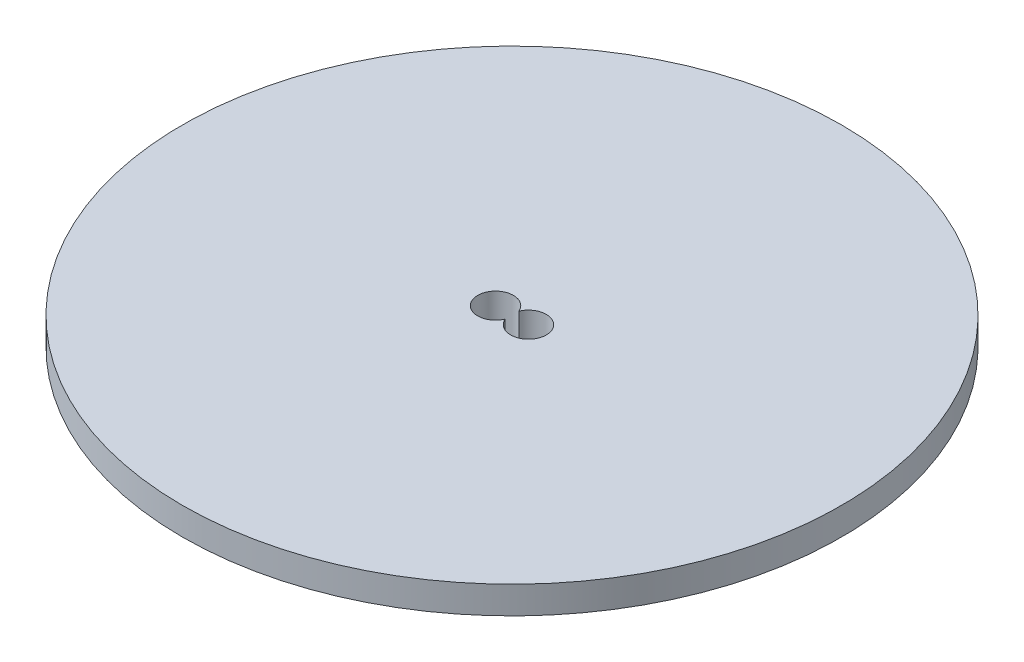
ISO-10303-21;
HEADER;
FILE_DESCRIPTION(('STEP AP214'),'2;1');
FILE_NAME('part.step','',(''),(''),'','','');
FILE_SCHEMA(('AUTOMOTIVE_DESIGN { 1 0 10303 214 1 1 1 1 }'));
ENDSEC;
DATA;
#1=APPLICATION_CONTEXT('core data for automotive mechanical design processes');
#2=APPLICATION_PROTOCOL_DEFINITION('international standard','automotive_design',2000,#1);
#3=PRODUCT_CONTEXT('',#1,'mechanical');
#4=PRODUCT('Part','Part','',(#3));
#5=PRODUCT_RELATED_PRODUCT_CATEGORY('part','',(#4));
#6=PRODUCT_DEFINITION_FORMATION('','',#4);
#7=PRODUCT_DEFINITION_CONTEXT('part definition',#1,'design');
#8=PRODUCT_DEFINITION('design','',#6,#7);
#9=PRODUCT_DEFINITION_SHAPE('','',#8);
#10=(LENGTH_UNIT() NAMED_UNIT(*) SI_UNIT(.MILLI.,.METRE.));
#11=(NAMED_UNIT(*) PLANE_ANGLE_UNIT() SI_UNIT($,.RADIAN.));
#12=(NAMED_UNIT(*) SI_UNIT($,.STERADIAN.) SOLID_ANGLE_UNIT());
#13=UNCERTAINTY_MEASURE_WITH_UNIT(LENGTH_MEASURE(1.E-05),#10,'distance_accuracy_value','');
#14=(GEOMETRIC_REPRESENTATION_CONTEXT(3) GLOBAL_UNCERTAINTY_ASSIGNED_CONTEXT((#13)) GLOBAL_UNIT_ASSIGNED_CONTEXT((#10,
#11,#12)) REPRESENTATION_CONTEXT('',''));
#15=CARTESIAN_POINT('',(0.,0.,0.));
#16=DIRECTION('',(0.,0.,1.));
#17=DIRECTION('',(1.,0.,0.));
#18=AXIS2_PLACEMENT_3D('',#15,#16,#17);
#19=CARTESIAN_POINT('',(0.,0.,0.));
#20=DIRECTION('',(0.,1.,0.));
#21=DIRECTION('',(0.,0.,1.));
#22=AXIS2_PLACEMENT_3D('',#19,#20,#21);
#23=PLANE('',#22);
#24=DIRECTION('',(0.,0.,1.));
#25=VECTOR('',#24,1.);
#26=CARTESIAN_POINT('',(-15.6602540378444,0.,0.));
#27=LINE('',#26,#25);
#28=CARTESIAN_POINT('',(-15.6602540378444,0.,-12.1602540378444));
#29=VERTEX_POINT('',#28);
#30=CARTESIAN_POINT('',(-15.6602540378444,0.,12.1602540378444));
#31=VERTEX_POINT('',#30);
#32=EDGE_CURVE('E57',#29,#31,#27,.T.);
#33=ORIENTED_EDGE('',*,*,#32,.T.);
#34=DIRECTION('',(1.,0.,0.));
#35=VECTOR('',#34,1.);
#36=CARTESIAN_POINT('',(0.,0.,12.1602540378444));
#37=LINE('',#36,#35);
#38=CARTESIAN_POINT('',(15.6602540378444,0.,12.1602540378444));
#39=VERTEX_POINT('',#38);
#40=EDGE_CURVE('E11',#31,#39,#37,.T.);
#41=ORIENTED_EDGE('',*,*,#40,.T.);
#42=DIRECTION('',(0.,0.,-1.));
#43=VECTOR('',#42,1.);
#44=CARTESIAN_POINT('',(15.6602540378444,0.,0.));
#45=LINE('',#44,#43);
#46=CARTESIAN_POINT('',(15.6602540378444,0.,-12.1602540378444));
#47=VERTEX_POINT('',#46);
#48=EDGE_CURVE('E42',#39,#47,#45,.T.);
#49=ORIENTED_EDGE('',*,*,#48,.T.);
#50=DIRECTION('',(-1.,0.,0.));
#51=VECTOR('',#50,1.);
#52=CARTESIAN_POINT('',(0.,0.,-12.1602540378444));
#53=LINE('',#52,#51);
#54=EDGE_CURVE('E128',#47,#29,#53,.T.);
#55=ORIENTED_EDGE('',*,*,#54,.T.);
#56=EDGE_LOOP('',(#33,#41,#49,#55));
#57=FACE_BOUND('',#56,.T.);
#58=CARTESIAN_POINT('',(0.,0.,0.));
#59=DIRECTION('',(0.,1.,0.));
#60=DIRECTION('',(0.,0.,1.));
#61=AXIS2_PLACEMENT_3D('',#58,#59,#60);
#62=CIRCLE('',#61,60.);
#63=CARTESIAN_POINT('',(0.,0.,60.));
#64=VERTEX_POINT('',#63);
#65=EDGE_CURVE('E124',#64,#64,#62,.T.);
#66=ORIENTED_EDGE('',*,*,#65,.F.);
#67=EDGE_LOOP('',(#66));
#68=FACE_BOUND('',#67,.T.);
#69=ADVANCED_FACE('F33',(#57,#68),#23,.F.);
#70=CARTESIAN_POINT('',(0.,5.,0.));
#71=DIRECTION('',(0.,-1.,0.));
#72=DIRECTION('',(0.,0.,-1.));
#73=AXIS2_PLACEMENT_3D('',#70,#71,#72);
#74=CYLINDRICAL_SURFACE('',#73,60.);
#75=CARTESIAN_POINT('',(0.,5.,0.));
#76=DIRECTION('',(0.,1.,0.));
#77=DIRECTION('',(0.,0.,1.));
#78=AXIS2_PLACEMENT_3D('',#75,#76,#77);
#79=CIRCLE('',#78,60.);
#80=CARTESIAN_POINT('',(0.,5.,60.));
#81=VERTEX_POINT('',#80);
#82=EDGE_CURVE('E125',#81,#81,#79,.T.);
#83=ORIENTED_EDGE('',*,*,#82,.F.);
#84=EDGE_LOOP('',(#83));
#85=FACE_BOUND('',#84,.T.);
#86=ORIENTED_EDGE('',*,*,#65,.T.);
#87=EDGE_LOOP('',(#86));
#88=FACE_BOUND('',#87,.T.);
#89=ADVANCED_FACE('F175',(#85,#88),#74,.T.);
#90=CARTESIAN_POINT('',(0.,5.,0.));
#91=DIRECTION('',(0.,1.,0.));
#92=DIRECTION('',(0.,0.,1.));
#93=AXIS2_PLACEMENT_3D('',#90,#91,#92);
#94=PLANE('',#93);
#95=CARTESIAN_POINT('',(-3.,5.,0.));
#96=DIRECTION('',(0.,1.,0.));
#97=DIRECTION('',(0.,0.,1.));
#98=AXIS2_PLACEMENT_3D('',#95,#96,#97);
#99=CIRCLE('',#98,3.25);
#100=CARTESIAN_POINT('',(0.,5.,-1.25));
#101=VERTEX_POINT('',#100);
#102=CARTESIAN_POINT('',(0.,5.,1.25));
#103=VERTEX_POINT('',#102);
#104=EDGE_CURVE('E95',#101,#103,#99,.T.);
#105=ORIENTED_EDGE('',*,*,#104,.F.);
#106=CARTESIAN_POINT('',(3.,5.,0.));
#107=DIRECTION('',(0.,1.,0.));
#108=DIRECTION('',(0.,0.,1.));
#109=AXIS2_PLACEMENT_3D('',#106,#107,#108);
#110=CIRCLE('',#109,3.25);
#111=EDGE_CURVE('E105',#103,#101,#110,.T.);
#112=ORIENTED_EDGE('',*,*,#111,.F.);
#113=EDGE_LOOP('',(#105,#112));
#114=FACE_BOUND('',#113,.T.);
#115=ORIENTED_EDGE('',*,*,#82,.T.);
#116=EDGE_LOOP('',(#115));
#117=FACE_BOUND('',#116,.T.);
#118=ADVANCED_FACE('F180',(#114,#117),#94,.T.);
#119=CARTESIAN_POINT('',(0.,-5.,0.));
#120=DIRECTION('',(0.,1.,0.));
#121=DIRECTION('',(0.,0.,1.));
#122=AXIS2_PLACEMENT_3D('',#119,#120,#121);
#123=PLANE('',#122);
#124=CARTESIAN_POINT('',(-3.,-5.,0.));
#125=DIRECTION('',(0.,1.,0.));
#126=DIRECTION('',(0.,0.,1.));
#127=AXIS2_PLACEMENT_3D('',#124,#125,#126);
#128=CIRCLE('',#127,1.75);
#129=CARTESIAN_POINT('',(-3.,-5.,1.75));
#130=VERTEX_POINT('',#129);
#131=EDGE_CURVE('E112',#130,#130,#128,.T.);
#132=ORIENTED_EDGE('',*,*,#131,.T.);
#133=EDGE_LOOP('',(#132));
#134=FACE_BOUND('',#133,.T.);
#135=CARTESIAN_POINT('',(3.,-5.,0.));
#136=DIRECTION('',(0.,1.,0.));
#137=DIRECTION('',(0.,0.,1.));
#138=AXIS2_PLACEMENT_3D('',#135,#136,#137);
#139=CIRCLE('',#138,1.75);
#140=CARTESIAN_POINT('',(3.,-5.,1.75));
#141=VERTEX_POINT('',#140);
#142=EDGE_CURVE('E133',#141,#141,#139,.T.);
#143=ORIENTED_EDGE('',*,*,#142,.T.);
#144=EDGE_LOOP('',(#143));
#145=FACE_BOUND('',#144,.T.);
#146=DIRECTION('',(0.,0.,1.));
#147=VECTOR('',#146,1.);
#148=CARTESIAN_POINT('',(7.,-5.,-3.5));
#149=LINE('',#148,#147);
#150=CARTESIAN_POINT('',(7.,-5.,-3.5));
#151=VERTEX_POINT('',#150);
#152=CARTESIAN_POINT('',(7.,-5.,3.5));
#153=VERTEX_POINT('',#152);
#154=EDGE_CURVE('E114',#151,#153,#149,.T.);
#155=ORIENTED_EDGE('',*,*,#154,.T.);
#156=DIRECTION('',(-1.,0.,0.));
#157=VECTOR('',#156,1.);
#158=CARTESIAN_POINT('',(-7.,-5.,3.5));
#159=LINE('',#158,#157);
#160=CARTESIAN_POINT('',(-7.,-5.,3.5));
#161=VERTEX_POINT('',#160);
#162=EDGE_CURVE('E117',#153,#161,#159,.T.);
#163=ORIENTED_EDGE('',*,*,#162,.T.);
#164=DIRECTION('',(0.,0.,-1.));
#165=VECTOR('',#164,1.);
#166=CARTESIAN_POINT('',(-7.,-5.,-3.5));
#167=LINE('',#166,#165);
#168=CARTESIAN_POINT('',(-7.,-5.,-3.5));
#169=VERTEX_POINT('',#168);
#170=EDGE_CURVE('E120',#161,#169,#167,.T.);
#171=ORIENTED_EDGE('',*,*,#170,.T.);
#172=DIRECTION('',(1.,0.,0.));
#173=VECTOR('',#172,1.);
#174=CARTESIAN_POINT('',(-7.,-5.,-3.5));
#175=LINE('',#174,#173);
#176=EDGE_CURVE('E122',#169,#151,#175,.T.);
#177=ORIENTED_EDGE('',*,*,#176,.T.);
#178=EDGE_LOOP('',(#155,#163,#171,#177));
#179=FACE_BOUND('',#178,.T.);
#180=ADVANCED_FACE('F159',(#134,#145,#179),#123,.F.);
#181=CARTESIAN_POINT('',(-3.,-4.,0.));
#182=DIRECTION('',(0.,1.,0.));
#183=DIRECTION('',(0.,0.,1.));
#184=AXIS2_PLACEMENT_3D('',#181,#182,#183);
#185=CYLINDRICAL_SURFACE('',#184,3.25);
#186=ORIENTED_EDGE('',*,*,#104,.T.);
#187=DIRECTION('',(0.,1.,0.));
#188=VECTOR('',#187,1.);
#189=CARTESIAN_POINT('',(0.,-4.,1.25));
#190=LINE('',#189,#188);
#191=CARTESIAN_POINT('',(0.,-4.,1.25));
#192=VERTEX_POINT('',#191);
#193=EDGE_CURVE('E89',#192,#103,#190,.T.);
#194=ORIENTED_EDGE('',*,*,#193,.F.);
#195=CARTESIAN_POINT('',(-3.,-4.,0.));
#196=DIRECTION('',(0.,1.,0.));
#197=DIRECTION('',(0.,0.,1.));
#198=AXIS2_PLACEMENT_3D('',#195,#196,#197);
#199=CIRCLE('',#198,3.25);
#200=CARTESIAN_POINT('',(0.,-4.,-1.25));
#201=VERTEX_POINT('',#200);
#202=EDGE_CURVE('E92',#201,#192,#199,.T.);
#203=ORIENTED_EDGE('',*,*,#202,.F.);
#204=DIRECTION('',(0.,1.,0.));
#205=VECTOR('',#204,1.);
#206=CARTESIAN_POINT('',(0.,-4.,-1.25));
#207=LINE('',#206,#205);
#208=EDGE_CURVE('E100',#201,#101,#207,.T.);
#209=ORIENTED_EDGE('',*,*,#208,.T.);
#210=EDGE_LOOP('',(#186,#194,#203,#209));
#211=FACE_BOUND('',#210,.T.);
#212=ADVANCED_FACE('F91',(#211),#185,.F.);
#213=CARTESIAN_POINT('',(3.,-4.,0.));
#214=DIRECTION('',(0.,1.,0.));
#215=DIRECTION('',(0.,0.,1.));
#216=AXIS2_PLACEMENT_3D('',#213,#214,#215);
#217=CYLINDRICAL_SURFACE('',#216,3.25);
#218=ORIENTED_EDGE('',*,*,#111,.T.);
#219=ORIENTED_EDGE('',*,*,#208,.F.);
#220=CARTESIAN_POINT('',(3.,-4.,0.));
#221=DIRECTION('',(0.,1.,0.));
#222=DIRECTION('',(0.,0.,1.));
#223=AXIS2_PLACEMENT_3D('',#220,#221,#222);
#224=CIRCLE('',#223,3.25);
#225=EDGE_CURVE('E101',#192,#201,#224,.T.);
#226=ORIENTED_EDGE('',*,*,#225,.F.);
#227=ORIENTED_EDGE('',*,*,#193,.T.);
#228=EDGE_LOOP('',(#218,#219,#226,#227));
#229=FACE_BOUND('',#228,.T.);
#230=ADVANCED_FACE('F107',(#229),#217,.F.);
#231=CARTESIAN_POINT('',(0.,-4.,0.));
#232=DIRECTION('',(0.,1.,0.));
#233=DIRECTION('',(0.,0.,1.));
#234=AXIS2_PLACEMENT_3D('',#231,#232,#233);
#235=PLANE('',#234);
#236=CARTESIAN_POINT('',(-3.,-4.,0.));
#237=DIRECTION('',(0.,1.,0.));
#238=DIRECTION('',(0.,0.,1.));
#239=AXIS2_PLACEMENT_3D('',#236,#237,#238);
#240=CIRCLE('',#239,1.75);
#241=CARTESIAN_POINT('',(-3.,-4.,1.75));
#242=VERTEX_POINT('',#241);
#243=EDGE_CURVE('E150',#242,#242,#240,.T.);
#244=ORIENTED_EDGE('',*,*,#243,.F.);
#245=EDGE_LOOP('',(#244));
#246=FACE_BOUND('',#245,.T.);
#247=CARTESIAN_POINT('',(3.,-4.,0.));
#248=DIRECTION('',(0.,1.,0.));
#249=DIRECTION('',(0.,0.,1.));
#250=AXIS2_PLACEMENT_3D('',#247,#248,#249);
#251=CIRCLE('',#250,1.75);
#252=CARTESIAN_POINT('',(3.,-4.,1.75));
#253=VERTEX_POINT('',#252);
#254=EDGE_CURVE('E145',#253,#253,#251,.T.);
#255=ORIENTED_EDGE('',*,*,#254,.F.);
#256=EDGE_LOOP('',(#255));
#257=FACE_BOUND('',#256,.T.);
#258=ORIENTED_EDGE('',*,*,#202,.T.);
#259=ORIENTED_EDGE('',*,*,#225,.T.);
#260=EDGE_LOOP('',(#258,#259));
#261=FACE_BOUND('',#260,.T.);
#262=ADVANCED_FACE('F104',(#246,#257,#261),#235,.T.);
#263=CARTESIAN_POINT('',(3.,-9.,0.));
#264=DIRECTION('',(0.,1.,0.));
#265=DIRECTION('',(0.,0.,1.));
#266=AXIS2_PLACEMENT_3D('',#263,#264,#265);
#267=CYLINDRICAL_SURFACE('',#266,1.75);
#268=ORIENTED_EDGE('',*,*,#254,.T.);
#269=EDGE_LOOP('',(#268));
#270=FACE_BOUND('',#269,.T.);
#271=ORIENTED_EDGE('',*,*,#142,.F.);
#272=EDGE_LOOP('',(#271));
#273=FACE_BOUND('',#272,.T.);
#274=ADVANCED_FACE('F162',(#270,#273),#267,.F.);
#275=CARTESIAN_POINT('',(-3.,-9.,0.));
#276=DIRECTION('',(0.,1.,0.));
#277=DIRECTION('',(0.,0.,1.));
#278=AXIS2_PLACEMENT_3D('',#275,#276,#277);
#279=CYLINDRICAL_SURFACE('',#278,1.75);
#280=ORIENTED_EDGE('',*,*,#243,.T.);
#281=EDGE_LOOP('',(#280));
#282=FACE_BOUND('',#281,.T.);
#283=ORIENTED_EDGE('',*,*,#131,.F.);
#284=EDGE_LOOP('',(#283));
#285=FACE_BOUND('',#284,.T.);
#286=ADVANCED_FACE('F164',(#282,#285),#279,.F.);
#287=CARTESIAN_POINT('',(-7.,-10.,-12.1602540378444));
#288=DIRECTION('',(-1.,0.,0.));
#289=DIRECTION('',(0.,0.,1.));
#290=AXIS2_PLACEMENT_3D('',#287,#288,#289);
#291=CYLINDRICAL_SURFACE('',#290,10.);
#292=CARTESIAN_POINT('',(-15.6602540378444,-10.,-12.1602540378444));
#293=DIRECTION('',(-0.707106781186547,0.,0.707106781186547));
#294=DIRECTION('',(-0.707106781186547,0.,-0.707106781186547));
#295=AXIS2_PLACEMENT_3D('',#292,#293,#294);
#296=ELLIPSE('',#295,14.1421356237309,10.);
#297=EDGE_CURVE('E139',#29,#169,#296,.F.);
#298=ORIENTED_EDGE('',*,*,#297,.F.);
#299=ORIENTED_EDGE('',*,*,#54,.F.);
#300=CARTESIAN_POINT('',(15.6602540378444,-10.,-12.1602540378444));
#301=DIRECTION('',(-0.707106781186547,0.,-0.707106781186547));
#302=DIRECTION('',(-0.707106781186547,0.,0.707106781186547));
#303=AXIS2_PLACEMENT_3D('',#300,#301,#302);
#304=ELLIPSE('',#303,14.1421356237309,10.);
#305=EDGE_CURVE('E37',#151,#47,#304,.T.);
#306=ORIENTED_EDGE('',*,*,#305,.F.);
#307=ORIENTED_EDGE('',*,*,#176,.F.);
#308=EDGE_LOOP('',(#298,#299,#306,#307));
#309=FACE_BOUND('',#308,.T.);
#310=ADVANCED_FACE('F35',(#309),#291,.F.);
#311=CARTESIAN_POINT('',(15.6602540378444,-10.,-3.5));
#312=DIRECTION('',(0.,0.,-1.));
#313=DIRECTION('',(-1.,0.,0.));
#314=AXIS2_PLACEMENT_3D('',#311,#312,#313);
#315=CYLINDRICAL_SURFACE('',#314,10.);
#316=ORIENTED_EDGE('',*,*,#305,.T.);
#317=ORIENTED_EDGE('',*,*,#48,.F.);
#318=CARTESIAN_POINT('',(15.6602540378444,-10.,12.1602540378444));
#319=DIRECTION('',(0.707106781186547,0.,-0.707106781186547));
#320=DIRECTION('',(-0.707106781186547,0.,-0.707106781186547));
#321=AXIS2_PLACEMENT_3D('',#318,#319,#320);
#322=ELLIPSE('',#321,14.1421356237309,10.);
#323=EDGE_CURVE('E50',#153,#39,#322,.T.);
#324=ORIENTED_EDGE('',*,*,#323,.F.);
#325=ORIENTED_EDGE('',*,*,#154,.F.);
#326=EDGE_LOOP('',(#316,#317,#324,#325));
#327=FACE_BOUND('',#326,.T.);
#328=ADVANCED_FACE('F192',(#327),#315,.F.);
#329=CARTESIAN_POINT('',(-15.6602540378444,-10.,-3.5));
#330=DIRECTION('',(0.,0.,1.));
#331=DIRECTION('',(1.,0.,0.));
#332=AXIS2_PLACEMENT_3D('',#329,#330,#331);
#333=CYLINDRICAL_SURFACE('',#332,10.);
#334=ORIENTED_EDGE('',*,*,#297,.T.);
#335=ORIENTED_EDGE('',*,*,#170,.F.);
#336=CARTESIAN_POINT('',(-15.6602540378444,-10.,12.1602540378444));
#337=DIRECTION('',(0.707106781186547,0.,0.707106781186547));
#338=DIRECTION('',(-0.707106781186547,0.,0.707106781186547));
#339=AXIS2_PLACEMENT_3D('',#336,#337,#338);
#340=ELLIPSE('',#339,14.1421356237309,10.);
#341=EDGE_CURVE('E137',#31,#161,#340,.F.);
#342=ORIENTED_EDGE('',*,*,#341,.F.);
#343=ORIENTED_EDGE('',*,*,#32,.F.);
#344=EDGE_LOOP('',(#334,#335,#342,#343));
#345=FACE_BOUND('',#344,.T.);
#346=ADVANCED_FACE('F190',(#345),#333,.F.);
#347=CARTESIAN_POINT('',(-7.,-10.,12.1602540378444));
#348=DIRECTION('',(1.,0.,0.));
#349=DIRECTION('',(0.,0.,-1.));
#350=AXIS2_PLACEMENT_3D('',#347,#348,#349);
#351=CYLINDRICAL_SURFACE('',#350,10.);
#352=ORIENTED_EDGE('',*,*,#323,.T.);
#353=ORIENTED_EDGE('',*,*,#40,.F.);
#354=ORIENTED_EDGE('',*,*,#341,.T.);
#355=ORIENTED_EDGE('',*,*,#162,.F.);
#356=EDGE_LOOP('',(#352,#353,#354,#355));
#357=FACE_BOUND('',#356,.T.);
#358=ADVANCED_FACE('F187',(#357),#351,.F.);
#359=CLOSED_SHELL('',(#69,#89,#118,#180,#212,#230,#262,#274,#286,#310,#328,#346,#358));
#360=MANIFOLD_SOLID_BREP('B2',#359);
#361=ADVANCED_BREP_SHAPE_REPRESENTATION('',(#18,#360),#14);
#362=SHAPE_DEFINITION_REPRESENTATION(#9,#361);
ENDSEC;
END-ISO-10303-21;
